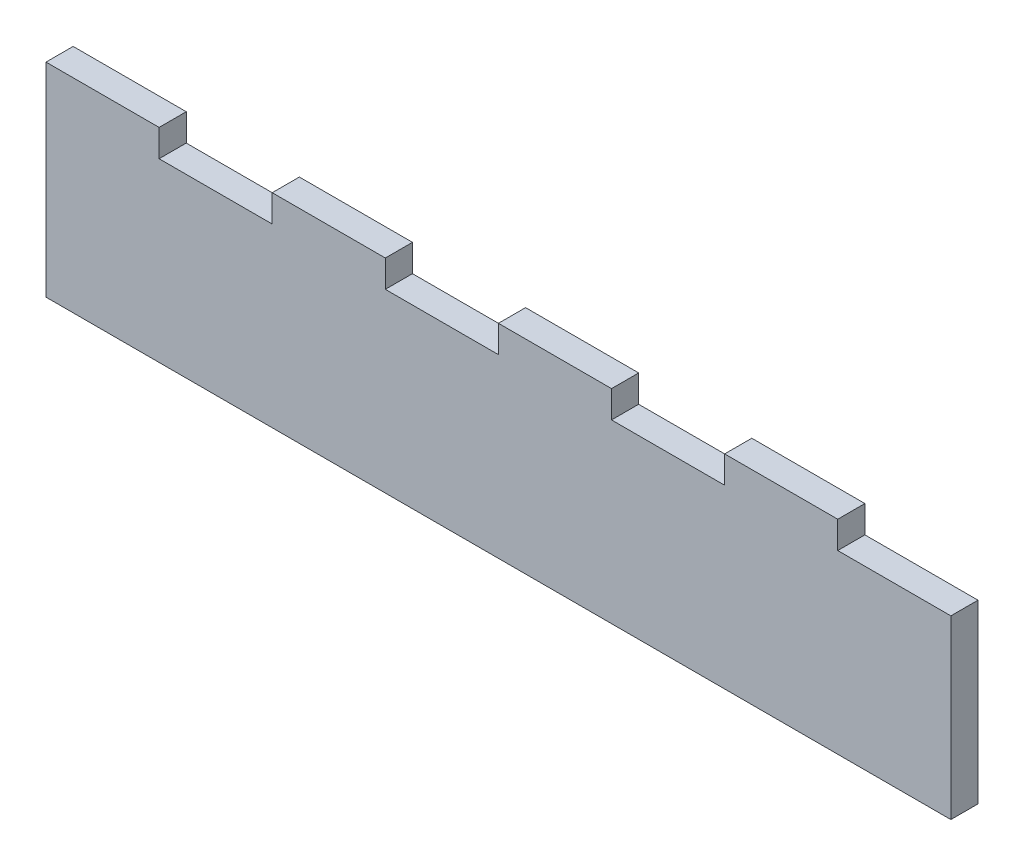
ISO-10303-21;
HEADER;
FILE_DESCRIPTION(('STEP AP214'),'2;1');
FILE_NAME('part.step','',(''),(''),'','','');
FILE_SCHEMA(('AUTOMOTIVE_DESIGN { 1 0 10303 214 1 1 1 1 }'));
ENDSEC;
DATA;
#1=APPLICATION_CONTEXT('core data for automotive mechanical design processes');
#2=APPLICATION_PROTOCOL_DEFINITION('international standard','automotive_design',2000,#1);
#3=PRODUCT_CONTEXT('',#1,'mechanical');
#4=PRODUCT('Part','Part','',(#3));
#5=PRODUCT_RELATED_PRODUCT_CATEGORY('part','',(#4));
#6=PRODUCT_DEFINITION_FORMATION('','',#4);
#7=PRODUCT_DEFINITION_CONTEXT('part definition',#1,'design');
#8=PRODUCT_DEFINITION('design','',#6,#7);
#9=PRODUCT_DEFINITION_SHAPE('','',#8);
#10=(LENGTH_UNIT() NAMED_UNIT(*) SI_UNIT(.MILLI.,.METRE.));
#11=(NAMED_UNIT(*) PLANE_ANGLE_UNIT() SI_UNIT($,.RADIAN.));
#12=(NAMED_UNIT(*) SI_UNIT($,.STERADIAN.) SOLID_ANGLE_UNIT());
#13=UNCERTAINTY_MEASURE_WITH_UNIT(LENGTH_MEASURE(1.E-05),#10,'distance_accuracy_value','');
#14=(GEOMETRIC_REPRESENTATION_CONTEXT(3) GLOBAL_UNCERTAINTY_ASSIGNED_CONTEXT((#13)) GLOBAL_UNIT_ASSIGNED_CONTEXT((#10,
#11,#12)) REPRESENTATION_CONTEXT('',''));
#15=CARTESIAN_POINT('',(0.,0.,0.));
#16=DIRECTION('',(0.,0.,1.));
#17=DIRECTION('',(1.,0.,0.));
#18=AXIS2_PLACEMENT_3D('',#15,#16,#17);
#19=CARTESIAN_POINT('',(0.,0.,6.));
#20=DIRECTION('',(0.,1.,0.));
#21=DIRECTION('',(0.,0.,1.));
#22=AXIS2_PLACEMENT_3D('',#19,#20,#21);
#23=PLANE('',#22);
#24=DIRECTION('',(1.,0.,0.));
#25=VECTOR('',#24,1.);
#26=CARTESIAN_POINT('',(0.,0.,0.));
#27=LINE('',#26,#25);
#28=CARTESIAN_POINT('',(0.,0.,0.));
#29=VERTEX_POINT('',#28);
#30=CARTESIAN_POINT('',(200.,0.,0.));
#31=VERTEX_POINT('',#30);
#32=EDGE_CURVE('E204',#29,#31,#27,.T.);
#33=ORIENTED_EDGE('',*,*,#32,.T.);
#34=DIRECTION('',(0.,0.,-1.));
#35=VECTOR('',#34,1.);
#36=CARTESIAN_POINT('',(200.,0.,6.));
#37=LINE('',#36,#35);
#38=CARTESIAN_POINT('',(200.,0.,6.));
#39=VERTEX_POINT('',#38);
#40=EDGE_CURVE('E48',#39,#31,#37,.T.);
#41=ORIENTED_EDGE('',*,*,#40,.F.);
#42=DIRECTION('',(1.,0.,0.));
#43=VECTOR('',#42,1.);
#44=CARTESIAN_POINT('',(0.,0.,6.));
#45=LINE('',#44,#43);
#46=CARTESIAN_POINT('',(0.,0.,6.));
#47=VERTEX_POINT('',#46);
#48=EDGE_CURVE('E130',#47,#39,#45,.T.);
#49=ORIENTED_EDGE('',*,*,#48,.F.);
#50=DIRECTION('',(0.,0.,-1.));
#51=VECTOR('',#50,1.);
#52=CARTESIAN_POINT('',(0.,0.,6.));
#53=LINE('',#52,#51);
#54=EDGE_CURVE('E11',#47,#29,#53,.T.);
#55=ORIENTED_EDGE('',*,*,#54,.T.);
#56=EDGE_LOOP('',(#33,#41,#49,#55));
#57=FACE_BOUND('',#56,.T.);
#58=ADVANCED_FACE('F39',(#57),#23,.F.);
#59=CARTESIAN_POINT('',(200.,0.,6.));
#60=DIRECTION('',(-1.,0.,0.));
#61=DIRECTION('',(0.,0.,1.));
#62=AXIS2_PLACEMENT_3D('',#59,#60,#61);
#63=PLANE('',#62);
#64=DIRECTION('',(0.,1.,0.));
#65=VECTOR('',#64,1.);
#66=CARTESIAN_POINT('',(200.,0.,0.));
#67=LINE('',#66,#65);
#68=CARTESIAN_POINT('',(200.,39.,0.));
#69=VERTEX_POINT('',#68);
#70=EDGE_CURVE('E207',#31,#69,#67,.T.);
#71=ORIENTED_EDGE('',*,*,#70,.T.);
#72=DIRECTION('',(0.,0.,-1.));
#73=VECTOR('',#72,1.);
#74=CARTESIAN_POINT('',(200.,39.,6.));
#75=LINE('',#74,#73);
#76=CARTESIAN_POINT('',(200.,39.,6.));
#77=VERTEX_POINT('',#76);
#78=EDGE_CURVE('E305',#77,#69,#75,.T.);
#79=ORIENTED_EDGE('',*,*,#78,.F.);
#80=DIRECTION('',(0.,1.,0.));
#81=VECTOR('',#80,1.);
#82=CARTESIAN_POINT('',(200.,0.,6.));
#83=LINE('',#82,#81);
#84=EDGE_CURVE('E315',#39,#77,#83,.T.);
#85=ORIENTED_EDGE('',*,*,#84,.F.);
#86=ORIENTED_EDGE('',*,*,#40,.T.);
#87=EDGE_LOOP('',(#71,#79,#85,#86));
#88=FACE_BOUND('',#87,.T.);
#89=ADVANCED_FACE('F313',(#88),#63,.F.);
#90=CARTESIAN_POINT('',(175.,39.,6.));
#91=DIRECTION('',(0.,-1.,0.));
#92=DIRECTION('',(0.,0.,-1.));
#93=AXIS2_PLACEMENT_3D('',#90,#91,#92);
#94=PLANE('',#93);
#95=DIRECTION('',(-1.,0.,0.));
#96=VECTOR('',#95,1.);
#97=CARTESIAN_POINT('',(175.,39.,0.));
#98=LINE('',#97,#96);
#99=CARTESIAN_POINT('',(175.,39.,0.));
#100=VERTEX_POINT('',#99);
#101=EDGE_CURVE('E210',#69,#100,#98,.T.);
#102=ORIENTED_EDGE('',*,*,#101,.T.);
#103=DIRECTION('',(0.,0.,-1.));
#104=VECTOR('',#103,1.);
#105=CARTESIAN_POINT('',(175.,39.,6.));
#106=LINE('',#105,#104);
#107=CARTESIAN_POINT('',(175.,39.,6.));
#108=VERTEX_POINT('',#107);
#109=EDGE_CURVE('E301',#108,#100,#106,.T.);
#110=ORIENTED_EDGE('',*,*,#109,.F.);
#111=DIRECTION('',(-1.,0.,0.));
#112=VECTOR('',#111,1.);
#113=CARTESIAN_POINT('',(175.,39.,6.));
#114=LINE('',#113,#112);
#115=EDGE_CURVE('E335',#77,#108,#114,.T.);
#116=ORIENTED_EDGE('',*,*,#115,.F.);
#117=ORIENTED_EDGE('',*,*,#78,.T.);
#118=EDGE_LOOP('',(#102,#110,#116,#117));
#119=FACE_BOUND('',#118,.T.);
#120=ADVANCED_FACE('F325',(#119),#94,.F.);
#121=CARTESIAN_POINT('',(175.,39.,6.));
#122=DIRECTION('',(-1.,0.,0.));
#123=DIRECTION('',(0.,0.,1.));
#124=AXIS2_PLACEMENT_3D('',#121,#122,#123);
#125=PLANE('',#124);
#126=DIRECTION('',(0.,1.,0.));
#127=VECTOR('',#126,1.);
#128=CARTESIAN_POINT('',(175.,39.,0.));
#129=LINE('',#128,#127);
#130=CARTESIAN_POINT('',(175.,45.,0.));
#131=VERTEX_POINT('',#130);
#132=EDGE_CURVE('E213',#100,#131,#129,.T.);
#133=ORIENTED_EDGE('',*,*,#132,.T.);
#134=DIRECTION('',(0.,0.,-1.));
#135=VECTOR('',#134,1.);
#136=CARTESIAN_POINT('',(175.,45.,6.));
#137=LINE('',#136,#135);
#138=CARTESIAN_POINT('',(175.,45.,6.));
#139=VERTEX_POINT('',#138);
#140=EDGE_CURVE('E297',#139,#131,#137,.T.);
#141=ORIENTED_EDGE('',*,*,#140,.F.);
#142=DIRECTION('',(0.,1.,0.));
#143=VECTOR('',#142,1.);
#144=CARTESIAN_POINT('',(175.,39.,6.));
#145=LINE('',#144,#143);
#146=EDGE_CURVE('E331',#108,#139,#145,.T.);
#147=ORIENTED_EDGE('',*,*,#146,.F.);
#148=ORIENTED_EDGE('',*,*,#109,.T.);
#149=EDGE_LOOP('',(#133,#141,#147,#148));
#150=FACE_BOUND('',#149,.T.);
#151=ADVANCED_FACE('F329',(#150),#125,.F.);
#152=CARTESIAN_POINT('',(150.,45.,6.));
#153=DIRECTION('',(0.,-1.,0.));
#154=DIRECTION('',(0.,0.,-1.));
#155=AXIS2_PLACEMENT_3D('',#152,#153,#154);
#156=PLANE('',#155);
#157=DIRECTION('',(-1.,0.,0.));
#158=VECTOR('',#157,1.);
#159=CARTESIAN_POINT('',(150.,45.,0.));
#160=LINE('',#159,#158);
#161=CARTESIAN_POINT('',(150.,45.,0.));
#162=VERTEX_POINT('',#161);
#163=EDGE_CURVE('E216',#131,#162,#160,.T.);
#164=ORIENTED_EDGE('',*,*,#163,.T.);
#165=DIRECTION('',(0.,0.,-1.));
#166=VECTOR('',#165,1.);
#167=CARTESIAN_POINT('',(150.,45.,6.));
#168=LINE('',#167,#166);
#169=CARTESIAN_POINT('',(150.,45.,6.));
#170=VERTEX_POINT('',#169);
#171=EDGE_CURVE('E293',#170,#162,#168,.T.);
#172=ORIENTED_EDGE('',*,*,#171,.F.);
#173=DIRECTION('',(-1.,0.,0.));
#174=VECTOR('',#173,1.);
#175=CARTESIAN_POINT('',(150.,45.,6.));
#176=LINE('',#175,#174);
#177=EDGE_CURVE('E334',#139,#170,#176,.T.);
#178=ORIENTED_EDGE('',*,*,#177,.F.);
#179=ORIENTED_EDGE('',*,*,#140,.T.);
#180=EDGE_LOOP('',(#164,#172,#178,#179));
#181=FACE_BOUND('',#180,.T.);
#182=ADVANCED_FACE('F403',(#181),#156,.F.);
#183=CARTESIAN_POINT('',(150.,39.,6.));
#184=DIRECTION('',(1.,0.,0.));
#185=DIRECTION('',(0.,0.,-1.));
#186=AXIS2_PLACEMENT_3D('',#183,#184,#185);
#187=PLANE('',#186);
#188=DIRECTION('',(0.,-1.,0.));
#189=VECTOR('',#188,1.);
#190=CARTESIAN_POINT('',(150.,39.,0.));
#191=LINE('',#190,#189);
#192=CARTESIAN_POINT('',(150.,39.,0.));
#193=VERTEX_POINT('',#192);
#194=EDGE_CURVE('E219',#162,#193,#191,.T.);
#195=ORIENTED_EDGE('',*,*,#194,.T.);
#196=DIRECTION('',(0.,0.,-1.));
#197=VECTOR('',#196,1.);
#198=CARTESIAN_POINT('',(150.,39.,6.));
#199=LINE('',#198,#197);
#200=CARTESIAN_POINT('',(150.,39.,6.));
#201=VERTEX_POINT('',#200);
#202=EDGE_CURVE('E289',#201,#193,#199,.T.);
#203=ORIENTED_EDGE('',*,*,#202,.F.);
#204=DIRECTION('',(0.,-1.,0.));
#205=VECTOR('',#204,1.);
#206=CARTESIAN_POINT('',(150.,39.,6.));
#207=LINE('',#206,#205);
#208=EDGE_CURVE('E339',#170,#201,#207,.T.);
#209=ORIENTED_EDGE('',*,*,#208,.F.);
#210=ORIENTED_EDGE('',*,*,#171,.T.);
#211=EDGE_LOOP('',(#195,#203,#209,#210));
#212=FACE_BOUND('',#211,.T.);
#213=ADVANCED_FACE('F406',(#212),#187,.F.);
#214=CARTESIAN_POINT('',(125.,39.,6.));
#215=DIRECTION('',(0.,-1.,0.));
#216=DIRECTION('',(0.,0.,-1.));
#217=AXIS2_PLACEMENT_3D('',#214,#215,#216);
#218=PLANE('',#217);
#219=DIRECTION('',(-1.,0.,0.));
#220=VECTOR('',#219,1.);
#221=CARTESIAN_POINT('',(125.,39.,0.));
#222=LINE('',#221,#220);
#223=CARTESIAN_POINT('',(125.,39.,0.));
#224=VERTEX_POINT('',#223);
#225=EDGE_CURVE('E222',#193,#224,#222,.T.);
#226=ORIENTED_EDGE('',*,*,#225,.T.);
#227=DIRECTION('',(0.,0.,-1.));
#228=VECTOR('',#227,1.);
#229=CARTESIAN_POINT('',(125.,39.,6.));
#230=LINE('',#229,#228);
#231=CARTESIAN_POINT('',(125.,39.,6.));
#232=VERTEX_POINT('',#231);
#233=EDGE_CURVE('E285',#232,#224,#230,.T.);
#234=ORIENTED_EDGE('',*,*,#233,.F.);
#235=DIRECTION('',(-1.,0.,0.));
#236=VECTOR('',#235,1.);
#237=CARTESIAN_POINT('',(125.,39.,6.));
#238=LINE('',#237,#236);
#239=EDGE_CURVE('E346',#201,#232,#238,.T.);
#240=ORIENTED_EDGE('',*,*,#239,.F.);
#241=ORIENTED_EDGE('',*,*,#202,.T.);
#242=EDGE_LOOP('',(#226,#234,#240,#241));
#243=FACE_BOUND('',#242,.T.);
#244=ADVANCED_FACE('F410',(#243),#218,.F.);
#245=CARTESIAN_POINT('',(125.,39.,6.));
#246=DIRECTION('',(-1.,0.,0.));
#247=DIRECTION('',(0.,0.,1.));
#248=AXIS2_PLACEMENT_3D('',#245,#246,#247);
#249=PLANE('',#248);
#250=DIRECTION('',(0.,1.,0.));
#251=VECTOR('',#250,1.);
#252=CARTESIAN_POINT('',(125.,39.,0.));
#253=LINE('',#252,#251);
#254=CARTESIAN_POINT('',(125.,45.,0.));
#255=VERTEX_POINT('',#254);
#256=EDGE_CURVE('E225',#224,#255,#253,.T.);
#257=ORIENTED_EDGE('',*,*,#256,.T.);
#258=DIRECTION('',(0.,0.,-1.));
#259=VECTOR('',#258,1.);
#260=CARTESIAN_POINT('',(125.,45.,6.));
#261=LINE('',#260,#259);
#262=CARTESIAN_POINT('',(125.,45.,6.));
#263=VERTEX_POINT('',#262);
#264=EDGE_CURVE('E281',#263,#255,#261,.T.);
#265=ORIENTED_EDGE('',*,*,#264,.F.);
#266=DIRECTION('',(0.,1.,0.));
#267=VECTOR('',#266,1.);
#268=CARTESIAN_POINT('',(125.,39.,6.));
#269=LINE('',#268,#267);
#270=EDGE_CURVE('E349',#232,#263,#269,.T.);
#271=ORIENTED_EDGE('',*,*,#270,.F.);
#272=ORIENTED_EDGE('',*,*,#233,.T.);
#273=EDGE_LOOP('',(#257,#265,#271,#272));
#274=FACE_BOUND('',#273,.T.);
#275=ADVANCED_FACE('F414',(#274),#249,.F.);
#276=CARTESIAN_POINT('',(100.,45.,6.));
#277=DIRECTION('',(0.,-1.,0.));
#278=DIRECTION('',(0.,0.,-1.));
#279=AXIS2_PLACEMENT_3D('',#276,#277,#278);
#280=PLANE('',#279);
#281=DIRECTION('',(-1.,0.,0.));
#282=VECTOR('',#281,1.);
#283=CARTESIAN_POINT('',(100.,45.,0.));
#284=LINE('',#283,#282);
#285=CARTESIAN_POINT('',(100.,45.,0.));
#286=VERTEX_POINT('',#285);
#287=EDGE_CURVE('E228',#255,#286,#284,.T.);
#288=ORIENTED_EDGE('',*,*,#287,.T.);
#289=DIRECTION('',(0.,0.,-1.));
#290=VECTOR('',#289,1.);
#291=CARTESIAN_POINT('',(100.,45.,6.));
#292=LINE('',#291,#290);
#293=CARTESIAN_POINT('',(100.,45.,6.));
#294=VERTEX_POINT('',#293);
#295=EDGE_CURVE('E277',#294,#286,#292,.T.);
#296=ORIENTED_EDGE('',*,*,#295,.F.);
#297=DIRECTION('',(-1.,0.,0.));
#298=VECTOR('',#297,1.);
#299=CARTESIAN_POINT('',(100.,45.,6.));
#300=LINE('',#299,#298);
#301=EDGE_CURVE('E352',#263,#294,#300,.T.);
#302=ORIENTED_EDGE('',*,*,#301,.F.);
#303=ORIENTED_EDGE('',*,*,#264,.T.);
#304=EDGE_LOOP('',(#288,#296,#302,#303));
#305=FACE_BOUND('',#304,.T.);
#306=ADVANCED_FACE('F418',(#305),#280,.F.);
#307=CARTESIAN_POINT('',(100.,39.,6.));
#308=DIRECTION('',(1.,0.,0.));
#309=DIRECTION('',(0.,0.,-1.));
#310=AXIS2_PLACEMENT_3D('',#307,#308,#309);
#311=PLANE('',#310);
#312=DIRECTION('',(0.,-1.,0.));
#313=VECTOR('',#312,1.);
#314=CARTESIAN_POINT('',(100.,39.,0.));
#315=LINE('',#314,#313);
#316=CARTESIAN_POINT('',(100.,39.,0.));
#317=VERTEX_POINT('',#316);
#318=EDGE_CURVE('E231',#286,#317,#315,.T.);
#319=ORIENTED_EDGE('',*,*,#318,.T.);
#320=DIRECTION('',(0.,0.,-1.));
#321=VECTOR('',#320,1.);
#322=CARTESIAN_POINT('',(100.,39.,6.));
#323=LINE('',#322,#321);
#324=CARTESIAN_POINT('',(100.,39.,6.));
#325=VERTEX_POINT('',#324);
#326=EDGE_CURVE('E273',#325,#317,#323,.T.);
#327=ORIENTED_EDGE('',*,*,#326,.F.);
#328=DIRECTION('',(0.,-1.,0.));
#329=VECTOR('',#328,1.);
#330=CARTESIAN_POINT('',(100.,39.,6.));
#331=LINE('',#330,#329);
#332=EDGE_CURVE('E355',#294,#325,#331,.T.);
#333=ORIENTED_EDGE('',*,*,#332,.F.);
#334=ORIENTED_EDGE('',*,*,#295,.T.);
#335=EDGE_LOOP('',(#319,#327,#333,#334));
#336=FACE_BOUND('',#335,.T.);
#337=ADVANCED_FACE('F422',(#336),#311,.F.);
#338=CARTESIAN_POINT('',(75.,39.,6.));
#339=DIRECTION('',(0.,-1.,0.));
#340=DIRECTION('',(0.,0.,-1.));
#341=AXIS2_PLACEMENT_3D('',#338,#339,#340);
#342=PLANE('',#341);
#343=DIRECTION('',(-1.,0.,0.));
#344=VECTOR('',#343,1.);
#345=CARTESIAN_POINT('',(75.,39.,0.));
#346=LINE('',#345,#344);
#347=CARTESIAN_POINT('',(75.,39.,0.));
#348=VERTEX_POINT('',#347);
#349=EDGE_CURVE('E234',#317,#348,#346,.T.);
#350=ORIENTED_EDGE('',*,*,#349,.T.);
#351=DIRECTION('',(0.,0.,-1.));
#352=VECTOR('',#351,1.);
#353=CARTESIAN_POINT('',(75.,39.,6.));
#354=LINE('',#353,#352);
#355=CARTESIAN_POINT('',(75.,39.,6.));
#356=VERTEX_POINT('',#355);
#357=EDGE_CURVE('E269',#356,#348,#354,.T.);
#358=ORIENTED_EDGE('',*,*,#357,.F.);
#359=DIRECTION('',(-1.,0.,0.));
#360=VECTOR('',#359,1.);
#361=CARTESIAN_POINT('',(75.,39.,6.));
#362=LINE('',#361,#360);
#363=EDGE_CURVE('E358',#325,#356,#362,.T.);
#364=ORIENTED_EDGE('',*,*,#363,.F.);
#365=ORIENTED_EDGE('',*,*,#326,.T.);
#366=EDGE_LOOP('',(#350,#358,#364,#365));
#367=FACE_BOUND('',#366,.T.);
#368=ADVANCED_FACE('F426',(#367),#342,.F.);
#369=CARTESIAN_POINT('',(75.,39.,6.));
#370=DIRECTION('',(-1.,0.,0.));
#371=DIRECTION('',(0.,0.,1.));
#372=AXIS2_PLACEMENT_3D('',#369,#370,#371);
#373=PLANE('',#372);
#374=DIRECTION('',(0.,1.,0.));
#375=VECTOR('',#374,1.);
#376=CARTESIAN_POINT('',(75.,39.,0.));
#377=LINE('',#376,#375);
#378=CARTESIAN_POINT('',(75.,45.,0.));
#379=VERTEX_POINT('',#378);
#380=EDGE_CURVE('E237',#348,#379,#377,.T.);
#381=ORIENTED_EDGE('',*,*,#380,.T.);
#382=DIRECTION('',(0.,0.,-1.));
#383=VECTOR('',#382,1.);
#384=CARTESIAN_POINT('',(75.,45.,6.));
#385=LINE('',#384,#383);
#386=CARTESIAN_POINT('',(75.,45.,6.));
#387=VERTEX_POINT('',#386);
#388=EDGE_CURVE('E265',#387,#379,#385,.T.);
#389=ORIENTED_EDGE('',*,*,#388,.F.);
#390=DIRECTION('',(0.,1.,0.));
#391=VECTOR('',#390,1.);
#392=CARTESIAN_POINT('',(75.,39.,6.));
#393=LINE('',#392,#391);
#394=EDGE_CURVE('E361',#356,#387,#393,.T.);
#395=ORIENTED_EDGE('',*,*,#394,.F.);
#396=ORIENTED_EDGE('',*,*,#357,.T.);
#397=EDGE_LOOP('',(#381,#389,#395,#396));
#398=FACE_BOUND('',#397,.T.);
#399=ADVANCED_FACE('F430',(#398),#373,.F.);
#400=CARTESIAN_POINT('',(50.,45.,6.));
#401=DIRECTION('',(0.,-1.,0.));
#402=DIRECTION('',(0.,0.,-1.));
#403=AXIS2_PLACEMENT_3D('',#400,#401,#402);
#404=PLANE('',#403);
#405=DIRECTION('',(-1.,0.,0.));
#406=VECTOR('',#405,1.);
#407=CARTESIAN_POINT('',(50.,45.,0.));
#408=LINE('',#407,#406);
#409=CARTESIAN_POINT('',(50.,45.,0.));
#410=VERTEX_POINT('',#409);
#411=EDGE_CURVE('E240',#379,#410,#408,.T.);
#412=ORIENTED_EDGE('',*,*,#411,.T.);
#413=DIRECTION('',(0.,0.,-1.));
#414=VECTOR('',#413,1.);
#415=CARTESIAN_POINT('',(50.,45.,6.));
#416=LINE('',#415,#414);
#417=CARTESIAN_POINT('',(50.,45.,6.));
#418=VERTEX_POINT('',#417);
#419=EDGE_CURVE('E261',#418,#410,#416,.T.);
#420=ORIENTED_EDGE('',*,*,#419,.F.);
#421=DIRECTION('',(-1.,0.,0.));
#422=VECTOR('',#421,1.);
#423=CARTESIAN_POINT('',(50.,45.,6.));
#424=LINE('',#423,#422);
#425=EDGE_CURVE('E364',#387,#418,#424,.T.);
#426=ORIENTED_EDGE('',*,*,#425,.F.);
#427=ORIENTED_EDGE('',*,*,#388,.T.);
#428=EDGE_LOOP('',(#412,#420,#426,#427));
#429=FACE_BOUND('',#428,.T.);
#430=ADVANCED_FACE('F372',(#429),#404,.F.);
#431=CARTESIAN_POINT('',(50.,39.,6.));
#432=DIRECTION('',(1.,0.,0.));
#433=DIRECTION('',(0.,0.,-1.));
#434=AXIS2_PLACEMENT_3D('',#431,#432,#433);
#435=PLANE('',#434);
#436=DIRECTION('',(0.,-1.,0.));
#437=VECTOR('',#436,1.);
#438=CARTESIAN_POINT('',(50.,39.,0.));
#439=LINE('',#438,#437);
#440=CARTESIAN_POINT('',(50.,39.,0.));
#441=VERTEX_POINT('',#440);
#442=EDGE_CURVE('E243',#410,#441,#439,.T.);
#443=ORIENTED_EDGE('',*,*,#442,.T.);
#444=DIRECTION('',(0.,0.,-1.));
#445=VECTOR('',#444,1.);
#446=CARTESIAN_POINT('',(50.,39.,6.));
#447=LINE('',#446,#445);
#448=CARTESIAN_POINT('',(50.,39.,6.));
#449=VERTEX_POINT('',#448);
#450=EDGE_CURVE('E191',#449,#441,#447,.T.);
#451=ORIENTED_EDGE('',*,*,#450,.F.);
#452=DIRECTION('',(0.,-1.,0.));
#453=VECTOR('',#452,1.);
#454=CARTESIAN_POINT('',(50.,39.,6.));
#455=LINE('',#454,#453);
#456=EDGE_CURVE('E180',#418,#449,#455,.T.);
#457=ORIENTED_EDGE('',*,*,#456,.F.);
#458=ORIENTED_EDGE('',*,*,#419,.T.);
#459=EDGE_LOOP('',(#443,#451,#457,#458));
#460=FACE_BOUND('',#459,.T.);
#461=ADVANCED_FACE('F376',(#460),#435,.F.);
#462=CARTESIAN_POINT('',(25.,39.,6.));
#463=DIRECTION('',(0.,-1.,0.));
#464=DIRECTION('',(0.,0.,-1.));
#465=AXIS2_PLACEMENT_3D('',#462,#463,#464);
#466=PLANE('',#465);
#467=DIRECTION('',(-1.,0.,0.));
#468=VECTOR('',#467,1.);
#469=CARTESIAN_POINT('',(25.,39.,0.));
#470=LINE('',#469,#468);
#471=CARTESIAN_POINT('',(25.,39.,0.));
#472=VERTEX_POINT('',#471);
#473=EDGE_CURVE('E189',#441,#472,#470,.T.);
#474=ORIENTED_EDGE('',*,*,#473,.T.);
#475=DIRECTION('',(0.,0.,-1.));
#476=VECTOR('',#475,1.);
#477=CARTESIAN_POINT('',(25.,39.,6.));
#478=LINE('',#477,#476);
#479=CARTESIAN_POINT('',(25.,39.,6.));
#480=VERTEX_POINT('',#479);
#481=EDGE_CURVE('E186',#480,#472,#478,.T.);
#482=ORIENTED_EDGE('',*,*,#481,.F.);
#483=DIRECTION('',(-1.,0.,0.));
#484=VECTOR('',#483,1.);
#485=CARTESIAN_POINT('',(25.,39.,6.));
#486=LINE('',#485,#484);
#487=EDGE_CURVE('E174',#449,#480,#486,.T.);
#488=ORIENTED_EDGE('',*,*,#487,.F.);
#489=ORIENTED_EDGE('',*,*,#450,.T.);
#490=EDGE_LOOP('',(#474,#482,#488,#489));
#491=FACE_BOUND('',#490,.T.);
#492=ADVANCED_FACE('F187',(#491),#466,.F.);
#493=CARTESIAN_POINT('',(25.,39.,6.));
#494=DIRECTION('',(-1.,0.,0.));
#495=DIRECTION('',(0.,0.,1.));
#496=AXIS2_PLACEMENT_3D('',#493,#494,#495);
#497=PLANE('',#496);
#498=DIRECTION('',(0.,1.,0.));
#499=VECTOR('',#498,1.);
#500=CARTESIAN_POINT('',(25.,39.,0.));
#501=LINE('',#500,#499);
#502=CARTESIAN_POINT('',(25.,45.,0.));
#503=VERTEX_POINT('',#502);
#504=EDGE_CURVE('E116',#472,#503,#501,.T.);
#505=ORIENTED_EDGE('',*,*,#504,.T.);
#506=DIRECTION('',(0.,0.,-1.));
#507=VECTOR('',#506,1.);
#508=CARTESIAN_POINT('',(25.,45.,6.));
#509=LINE('',#508,#507);
#510=CARTESIAN_POINT('',(25.,45.,6.));
#511=VERTEX_POINT('',#510);
#512=EDGE_CURVE('E192',#511,#503,#509,.T.);
#513=ORIENTED_EDGE('',*,*,#512,.F.);
#514=DIRECTION('',(0.,1.,0.));
#515=VECTOR('',#514,1.);
#516=CARTESIAN_POINT('',(25.,39.,6.));
#517=LINE('',#516,#515);
#518=EDGE_CURVE('E178',#480,#511,#517,.T.);
#519=ORIENTED_EDGE('',*,*,#518,.F.);
#520=ORIENTED_EDGE('',*,*,#481,.T.);
#521=EDGE_LOOP('',(#505,#513,#519,#520));
#522=FACE_BOUND('',#521,.T.);
#523=ADVANCED_FACE('F194',(#522),#497,.F.);
#524=CARTESIAN_POINT('',(0.,45.,6.));
#525=DIRECTION('',(0.,-1.,0.));
#526=DIRECTION('',(0.,0.,-1.));
#527=AXIS2_PLACEMENT_3D('',#524,#525,#526);
#528=PLANE('',#527);
#529=DIRECTION('',(-1.,0.,0.));
#530=VECTOR('',#529,1.);
#531=CARTESIAN_POINT('',(0.,45.,0.));
#532=LINE('',#531,#530);
#533=CARTESIAN_POINT('',(0.,45.,0.));
#534=VERTEX_POINT('',#533);
#535=EDGE_CURVE('E123',#503,#534,#532,.T.);
#536=ORIENTED_EDGE('',*,*,#535,.T.);
#537=DIRECTION('',(0.,0.,-1.));
#538=VECTOR('',#537,1.);
#539=CARTESIAN_POINT('',(0.,45.,6.));
#540=LINE('',#539,#538);
#541=CARTESIAN_POINT('',(0.,45.,6.));
#542=VERTEX_POINT('',#541);
#543=EDGE_CURVE('E200',#542,#534,#540,.T.);
#544=ORIENTED_EDGE('',*,*,#543,.F.);
#545=DIRECTION('',(-1.,0.,0.));
#546=VECTOR('',#545,1.);
#547=CARTESIAN_POINT('',(0.,45.,6.));
#548=LINE('',#547,#546);
#549=EDGE_CURVE('E197',#511,#542,#548,.T.);
#550=ORIENTED_EDGE('',*,*,#549,.F.);
#551=ORIENTED_EDGE('',*,*,#512,.T.);
#552=EDGE_LOOP('',(#536,#544,#550,#551));
#553=FACE_BOUND('',#552,.T.);
#554=ADVANCED_FACE('F378',(#553),#528,.F.);
#555=CARTESIAN_POINT('',(0.,39.,6.));
#556=DIRECTION('',(1.,0.,0.));
#557=DIRECTION('',(0.,0.,-1.));
#558=AXIS2_PLACEMENT_3D('',#555,#556,#557);
#559=PLANE('',#558);
#560=DIRECTION('',(0.,-1.,0.));
#561=VECTOR('',#560,1.);
#562=CARTESIAN_POINT('',(0.,39.,0.));
#563=LINE('',#562,#561);
#564=EDGE_CURVE('E252',#534,#29,#563,.T.);
#565=ORIENTED_EDGE('',*,*,#564,.T.);
#566=ORIENTED_EDGE('',*,*,#54,.F.);
#567=DIRECTION('',(0.,-1.,0.));
#568=VECTOR('',#567,1.);
#569=CARTESIAN_POINT('',(0.,0.,6.));
#570=LINE('',#569,#568);
#571=EDGE_CURVE('E56',#542,#47,#570,.T.);
#572=ORIENTED_EDGE('',*,*,#571,.F.);
#573=ORIENTED_EDGE('',*,*,#543,.T.);
#574=EDGE_LOOP('',(#565,#566,#572,#573));
#575=FACE_BOUND('',#574,.T.);
#576=ADVANCED_FACE('F377',(#575),#559,.F.);
#577=CARTESIAN_POINT('',(0.,0.,6.));
#578=DIRECTION('',(0.,0.,-1.));
#579=DIRECTION('',(-1.,0.,0.));
#580=AXIS2_PLACEMENT_3D('',#577,#578,#579);
#581=PLANE('',#580);
#582=ORIENTED_EDGE('',*,*,#571,.T.);
#583=ORIENTED_EDGE('',*,*,#48,.T.);
#584=ORIENTED_EDGE('',*,*,#84,.T.);
#585=ORIENTED_EDGE('',*,*,#115,.T.);
#586=ORIENTED_EDGE('',*,*,#146,.T.);
#587=ORIENTED_EDGE('',*,*,#177,.T.);
#588=ORIENTED_EDGE('',*,*,#208,.T.);
#589=ORIENTED_EDGE('',*,*,#239,.T.);
#590=ORIENTED_EDGE('',*,*,#270,.T.);
#591=ORIENTED_EDGE('',*,*,#301,.T.);
#592=ORIENTED_EDGE('',*,*,#332,.T.);
#593=ORIENTED_EDGE('',*,*,#363,.T.);
#594=ORIENTED_EDGE('',*,*,#394,.T.);
#595=ORIENTED_EDGE('',*,*,#425,.T.);
#596=ORIENTED_EDGE('',*,*,#456,.T.);
#597=ORIENTED_EDGE('',*,*,#487,.T.);
#598=ORIENTED_EDGE('',*,*,#518,.T.);
#599=ORIENTED_EDGE('',*,*,#549,.T.);
#600=EDGE_LOOP('',(#582,#583,#584,#585,#586,#587,#588,#589,#590,#591,#592,#593,#594,#595,#596,
#597,#598,#599));
#601=FACE_BOUND('',#600,.T.);
#602=ADVANCED_FACE('F176',(#601),#581,.F.);
#603=CARTESIAN_POINT('',(0.,0.,0.));
#604=DIRECTION('',(0.,0.,-1.));
#605=DIRECTION('',(-1.,0.,0.));
#606=AXIS2_PLACEMENT_3D('',#603,#604,#605);
#607=PLANE('',#606);
#608=ORIENTED_EDGE('',*,*,#32,.F.);
#609=ORIENTED_EDGE('',*,*,#564,.F.);
#610=ORIENTED_EDGE('',*,*,#535,.F.);
#611=ORIENTED_EDGE('',*,*,#504,.F.);
#612=ORIENTED_EDGE('',*,*,#473,.F.);
#613=ORIENTED_EDGE('',*,*,#442,.F.);
#614=ORIENTED_EDGE('',*,*,#411,.F.);
#615=ORIENTED_EDGE('',*,*,#380,.F.);
#616=ORIENTED_EDGE('',*,*,#349,.F.);
#617=ORIENTED_EDGE('',*,*,#318,.F.);
#618=ORIENTED_EDGE('',*,*,#287,.F.);
#619=ORIENTED_EDGE('',*,*,#256,.F.);
#620=ORIENTED_EDGE('',*,*,#225,.F.);
#621=ORIENTED_EDGE('',*,*,#194,.F.);
#622=ORIENTED_EDGE('',*,*,#163,.F.);
#623=ORIENTED_EDGE('',*,*,#132,.F.);
#624=ORIENTED_EDGE('',*,*,#101,.F.);
#625=ORIENTED_EDGE('',*,*,#70,.F.);
#626=EDGE_LOOP('',(#608,#609,#610,#611,#612,#613,#614,#615,#616,#617,#618,#619,#620,#621,#622,
#623,#624,#625));
#627=FACE_BOUND('',#626,.T.);
#628=ADVANCED_FACE('F319',(#627),#607,.T.);
#629=CLOSED_SHELL('',(#58,#89,#120,#151,#182,#213,#244,#275,#306,#337,#368,#399,#430,#461,#492,
#523,#554,#576,#602,#628));
#630=MANIFOLD_SOLID_BREP('B2',#629);
#631=ADVANCED_BREP_SHAPE_REPRESENTATION('',(#18,#630),#14);
#632=SHAPE_DEFINITION_REPRESENTATION(#9,#631);
ENDSEC;
END-ISO-10303-21;
